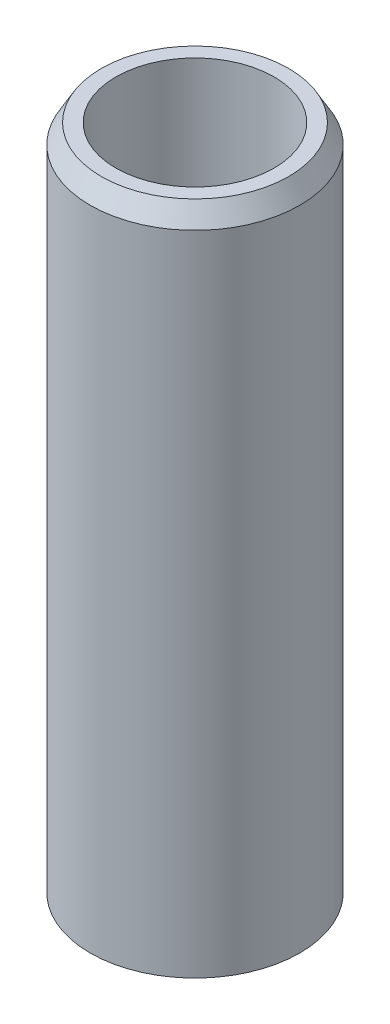
ISO-10303-21;
HEADER;
FILE_DESCRIPTION(('STEP AP214'),'2;1');
FILE_NAME('part.step','',(''),(''),'','','');
FILE_SCHEMA(('AUTOMOTIVE_DESIGN { 1 0 10303 214 1 1 1 1 }'));
ENDSEC;
DATA;
#1=APPLICATION_CONTEXT('core data for automotive mechanical design processes');
#2=APPLICATION_PROTOCOL_DEFINITION('international standard','automotive_design',2000,#1);
#3=PRODUCT_CONTEXT('',#1,'mechanical');
#4=PRODUCT('Part','Part','',(#3));
#5=PRODUCT_RELATED_PRODUCT_CATEGORY('part','',(#4));
#6=PRODUCT_DEFINITION_FORMATION('','',#4);
#7=PRODUCT_DEFINITION_CONTEXT('part definition',#1,'design');
#8=PRODUCT_DEFINITION('design','',#6,#7);
#9=PRODUCT_DEFINITION_SHAPE('','',#8);
#10=(LENGTH_UNIT() NAMED_UNIT(*) SI_UNIT(.MILLI.,.METRE.));
#11=(NAMED_UNIT(*) PLANE_ANGLE_UNIT() SI_UNIT($,.RADIAN.));
#12=(NAMED_UNIT(*) SI_UNIT($,.STERADIAN.) SOLID_ANGLE_UNIT());
#13=UNCERTAINTY_MEASURE_WITH_UNIT(LENGTH_MEASURE(1.E-05),#10,'distance_accuracy_value','');
#14=(GEOMETRIC_REPRESENTATION_CONTEXT(3) GLOBAL_UNCERTAINTY_ASSIGNED_CONTEXT((#13)) GLOBAL_UNIT_ASSIGNED_CONTEXT((#10,
#11,#12)) REPRESENTATION_CONTEXT('',''));
#15=CARTESIAN_POINT('',(0.,0.,0.));
#16=DIRECTION('',(0.,0.,1.));
#17=DIRECTION('',(1.,0.,0.));
#18=AXIS2_PLACEMENT_3D('',#15,#16,#17);
#19=CARTESIAN_POINT('',(0.,210.218991264737,0.));
#20=DIRECTION('',(0.,-1.,0.));
#21=DIRECTION('',(0.,0.,-1.));
#22=AXIS2_PLACEMENT_3D('',#19,#20,#21);
#23=CYLINDRICAL_SURFACE('',#22,32.5);
#24=CARTESIAN_POINT('',(0.,204.233746215276,0.));
#25=DIRECTION('',(0.,1.,0.));
#26=DIRECTION('',(0.,0.,1.));
#27=AXIS2_PLACEMENT_3D('',#24,#25,#26);
#28=CIRCLE('',#27,32.5);
#29=CARTESIAN_POINT('',(0.,204.233746215276,-32.5));
#30=VERTEX_POINT('',#29);
#31=EDGE_CURVE('E50',#30,#30,#28,.F.);
#32=CARTESIAN_POINT('',(0.,3.45558284047212,0.));
#33=DIRECTION('',(0.,1.,0.));
#34=DIRECTION('',(0.,0.,1.));
#35=AXIS2_PLACEMENT_3D('',#32,#33,#34);
#36=CIRCLE('',#35,32.5);
#37=CARTESIAN_POINT('',(0.,3.45558284047209,-32.5));
#38=VERTEX_POINT('',#37);
#39=EDGE_CURVE('E51',#38,#38,#36,.T.);
#40=CARTESIAN_POINT('',(0.,204.233746215276,-32.5));
#41=CARTESIAN_POINT('',(0.,202.142307013455,-32.5));
#42=CARTESIAN_POINT('',(0.,200.050867811635,-32.5));
#43=CARTESIAN_POINT('',(0.,195.867989407993,-32.5));
#44=CARTESIAN_POINT('',(0.,193.776550206172,-32.5));
#45=CARTESIAN_POINT('',(0.,189.59367180253,-32.5));
#46=CARTESIAN_POINT('',(0.,187.502232600709,-32.5));
#47=CARTESIAN_POINT('',(0.,183.319354197068,-32.5));
#48=CARTESIAN_POINT('',(0.,181.227914995247,-32.5));
#49=CARTESIAN_POINT('',(0.,177.045036591605,-32.5));
#50=CARTESIAN_POINT('',(0.,174.953597389784,-32.5));
#51=CARTESIAN_POINT('',(0.,170.770718986142,-32.5));
#52=CARTESIAN_POINT('',(0.,168.679279784321,-32.5));
#53=CARTESIAN_POINT('',(0.,164.49640138068,-32.5));
#54=CARTESIAN_POINT('',(0.,162.404962178859,-32.5));
#55=CARTESIAN_POINT('',(0.,158.222083775217,-32.5));
#56=CARTESIAN_POINT('',(0.,156.130644573396,-32.5));
#57=CARTESIAN_POINT('',(0.,151.947766169754,-32.5));
#58=CARTESIAN_POINT('',(0.,149.856326967934,-32.5));
#59=CARTESIAN_POINT('',(0.,145.673448564292,-32.5));
#60=CARTESIAN_POINT('',(0.,143.582009362471,-32.5));
#61=CARTESIAN_POINT('',(0.,139.399130958829,-32.5));
#62=CARTESIAN_POINT('',(0.,137.307691757008,-32.5));
#63=CARTESIAN_POINT('',(0.,133.124813353367,-32.5));
#64=CARTESIAN_POINT('',(0.,131.033374151546,-32.5));
#65=CARTESIAN_POINT('',(0.,126.850495747904,-32.5));
#66=CARTESIAN_POINT('',(0.,124.759056546083,-32.5));
#67=CARTESIAN_POINT('',(0.,120.576178142441,-32.5));
#68=CARTESIAN_POINT('',(0.,118.48473894062,-32.5));
#69=CARTESIAN_POINT('',(0.,114.301860536979,-32.5));
#70=CARTESIAN_POINT('',(0.,112.210421335158,-32.5));
#71=CARTESIAN_POINT('',(0.,108.027542931516,-32.5));
#72=CARTESIAN_POINT('',(0.,105.936103729695,-32.5));
#73=CARTESIAN_POINT('',(0.,101.753225326053,-32.5));
#74=CARTESIAN_POINT('',(0.,99.6617861242325,-32.5));
#75=CARTESIAN_POINT('',(0.,95.4789077205907,-32.5));
#76=CARTESIAN_POINT('',(0.,93.3874685187698,-32.5));
#77=CARTESIAN_POINT('',(0.,89.2045901151281,-32.5));
#78=CARTESIAN_POINT('',(0.,87.1131509133072,-32.5));
#79=CARTESIAN_POINT('',(0.,82.9302725096654,-32.5));
#80=CARTESIAN_POINT('',(0.,80.8388333078446,-32.5));
#81=CARTESIAN_POINT('',(0.,76.6559549042028,-32.5));
#82=CARTESIAN_POINT('',(0.,74.5645157023819,-32.5));
#83=CARTESIAN_POINT('',(0.,70.3816372987402,-32.5));
#84=CARTESIAN_POINT('',(0.,68.2901980969193,-32.5));
#85=CARTESIAN_POINT('',(0.,64.1073196932775,-32.5));
#86=CARTESIAN_POINT('',(0.,62.0158804914567,-32.5));
#87=CARTESIAN_POINT('',(0.,57.8330020878149,-32.5));
#88=CARTESIAN_POINT('',(0.,55.741562885994,-32.5));
#89=CARTESIAN_POINT('',(0.,51.5586844823523,-32.5));
#90=CARTESIAN_POINT('',(0.,49.4672452805314,-32.5));
#91=CARTESIAN_POINT('',(0.,45.2843668768896,-32.5));
#92=CARTESIAN_POINT('',(0.,43.1929276750688,-32.5));
#93=CARTESIAN_POINT('',(0.,39.010049271427,-32.5));
#94=CARTESIAN_POINT('',(0.,36.9186100696061,-32.5));
#95=CARTESIAN_POINT('',(0.,32.7357316659644,-32.5));
#96=CARTESIAN_POINT('',(0.,30.6442924641435,-32.5));
#97=CARTESIAN_POINT('',(0.,26.4614140605017,-32.5));
#98=CARTESIAN_POINT('',(0.,24.3699748586809,-32.5));
#99=CARTESIAN_POINT('',(0.,20.1870964550391,-32.5));
#100=CARTESIAN_POINT('',(0.,18.0956572532182,-32.5));
#101=CARTESIAN_POINT('',(0.,13.9127788495765,-32.5));
#102=CARTESIAN_POINT('',(0.,11.8213396477556,-32.5));
#103=CARTESIAN_POINT('',(0.,7.63846124411383,-32.5));
#104=CARTESIAN_POINT('',(0.,5.54702204229296,-32.5));
#105=CARTESIAN_POINT('',(0.,3.45558284047209,-32.5));
#106=B_SPLINE_CURVE_WITH_KNOTS('',3,(#40,#41,#42,#43,#44,#45,#46,#47,#48,#49,#50,#51,#52,#53,
#54,#55,#56,#57,#58,#59,#60,#61,#62,#63,#64,#65,#66,#67,#68,#69,#70,#71,#72,#73,#74,#75,#76,#77,
#78,#79,#80,#81,#82,#83,#84,#85,#86,#87,#88,#89,#90,#91,#92,#93,#94,#95,#96,#97,#98,#99,#100,
#101,#102,#103,#104,#105),.UNSPECIFIED.,.F.,.F.,(4,2,2,2,2,2,2,2,2,2,2,2,2,2,2,2,2,2,2,2,2,2,2,
2,2,2,2,2,2,2,2,2,4),(0.,6.27431760546265,12.5486352109253,18.8229528163879,25.0972704218506,
31.3715880273132,37.6459056327758,43.9202232382384,50.1945408437011,56.4688584491637,
62.7431760546263,69.017493660089,75.2918112655516,81.5661288710142,87.8404464764769,
94.1147640819395,100.389081687402,106.663399292865,112.937716898327,119.21203450379,
125.486352109253,131.760669714715,138.034987320178,144.309304925641,150.583622531103,
156.857940136566,163.132257742028,169.406575347491,175.680892952954,181.955210558416,
188.229528163879,194.503845769342,200.778163374804),.UNSPECIFIED.);
#107=EDGE_CURVE('BSEAM39',#30,#38,#106,.T.);
#108=ORIENTED_EDGE('',*,*,#31,.T.);
#109=ORIENTED_EDGE('',*,*,#39,.T.);
#110=ORIENTED_EDGE('',*,*,#107,.T.);
#111=ORIENTED_EDGE('',*,*,#107,.F.);
#112=EDGE_LOOP('',(#108,#110,#109,#111));
#113=FACE_BOUND('',#112,.T.);
#114=ADVANCED_FACE('F39',(#113),#23,.T.);
#115=CARTESIAN_POINT('',(0.,210.218991264737,0.));
#116=DIRECTION('',(0.,1.,0.));
#117=DIRECTION('',(0.,0.,1.));
#118=AXIS2_PLACEMENT_3D('',#115,#116,#117);
#119=PLANE('',#118);
#120=CARTESIAN_POINT('',(0.,210.218991264737,0.));
#121=DIRECTION('',(0.,1.,0.));
#122=DIRECTION('',(0.,0.,1.));
#123=AXIS2_PLACEMENT_3D('',#120,#121,#122);
#124=CIRCLE('',#123,29.0444171595281);
#125=CARTESIAN_POINT('',(0.,210.218991264737,29.0444171595281));
#126=VERTEX_POINT('',#125);
#127=EDGE_CURVE('E54',#126,#126,#124,.T.);
#128=ORIENTED_EDGE('',*,*,#127,.T.);
#129=EDGE_LOOP('',(#128));
#130=FACE_BOUND('',#129,.T.);
#131=CARTESIAN_POINT('',(0.,210.218991264737,0.));
#132=DIRECTION('',(0.,1.,0.));
#133=DIRECTION('',(0.,0.,1.));
#134=AXIS2_PLACEMENT_3D('',#131,#132,#133);
#135=CIRCLE('',#134,24.5213171670989);
#136=CARTESIAN_POINT('',(0.,210.218991264737,-24.5213171670989));
#137=VERTEX_POINT('',#136);
#138=EDGE_CURVE('E58',#137,#137,#135,.T.);
#139=ORIENTED_EDGE('',*,*,#138,.F.);
#140=EDGE_LOOP('',(#139));
#141=FACE_BOUND('',#140,.T.);
#142=ADVANCED_FACE('F69',(#130,#141),#119,.T.);
#143=CARTESIAN_POINT('',(0.,0.,0.));
#144=DIRECTION('',(0.,1.,0.));
#145=DIRECTION('',(0.,0.,1.));
#146=AXIS2_PLACEMENT_3D('',#143,#144,#145);
#147=PLANE('',#146);
#148=CARTESIAN_POINT('',(0.,0.,0.));
#149=DIRECTION('',(0.,1.,0.));
#150=DIRECTION('',(0.,0.,1.));
#151=AXIS2_PLACEMENT_3D('',#148,#149,#150);
#152=CIRCLE('',#151,26.5147549505391);
#153=CARTESIAN_POINT('',(0.,0.,26.5147549505391));
#154=VERTEX_POINT('',#153);
#155=EDGE_CURVE('E10',#154,#154,#152,.F.);
#156=ORIENTED_EDGE('',*,*,#155,.T.);
#157=EDGE_LOOP('',(#156));
#158=FACE_BOUND('',#157,.T.);
#159=CARTESIAN_POINT('',(0.,0.,0.));
#160=DIRECTION('',(0.,1.,0.));
#161=DIRECTION('',(0.,0.,1.));
#162=AXIS2_PLACEMENT_3D('',#159,#160,#161);
#163=CIRCLE('',#162,24.5213171670989);
#164=CARTESIAN_POINT('',(0.,0.,-24.5213171670989));
#165=VERTEX_POINT('',#164);
#166=EDGE_CURVE('E63',#165,#165,#163,.T.);
#167=ORIENTED_EDGE('',*,*,#166,.T.);
#168=EDGE_LOOP('',(#167));
#169=FACE_BOUND('',#168,.T.);
#170=ADVANCED_FACE('F75',(#158,#169),#147,.F.);
#171=CARTESIAN_POINT('',(0.,210.218991264737,0.));
#172=DIRECTION('',(0.,-1.,0.));
#173=DIRECTION('',(0.,0.,-1.));
#174=AXIS2_PLACEMENT_3D('',#171,#172,#173);
#175=CYLINDRICAL_SURFACE('',#174,24.5213171670989);
#176=CARTESIAN_POINT('',(0.,210.218991264737,-24.5213171670989));
#177=CARTESIAN_POINT('',(0.,208.029210105729,-24.5213171670989));
#178=CARTESIAN_POINT('',(0.,205.839428946722,-24.5213171670989));
#179=CARTESIAN_POINT('',(0.,201.459866628706,-24.5213171670989));
#180=CARTESIAN_POINT('',(0.,199.270085469699,-24.5213171670989));
#181=CARTESIAN_POINT('',(0.,194.890523151683,-24.5213171670989));
#182=CARTESIAN_POINT('',(0.,192.700741992676,-24.5213171670989));
#183=CARTESIAN_POINT('',(0.,188.32117967466,-24.5213171670989));
#184=CARTESIAN_POINT('',(0.,186.131398515653,-24.5213171670989));
#185=CARTESIAN_POINT('',(0.,181.751836197637,-24.5213171670989));
#186=CARTESIAN_POINT('',(0.,179.56205503863,-24.5213171670989));
#187=CARTESIAN_POINT('',(0.,175.182492720614,-24.5213171670989));
#188=CARTESIAN_POINT('',(0.,172.992711561606,-24.5213171670989));
#189=CARTESIAN_POINT('',(0.,168.613149243591,-24.5213171670989));
#190=CARTESIAN_POINT('',(0.,166.423368084583,-24.5213171670989));
#191=CARTESIAN_POINT('',(0.,162.043805766568,-24.5213171670989));
#192=CARTESIAN_POINT('',(0.,159.85402460756,-24.5213171670989));
#193=CARTESIAN_POINT('',(0.,155.474462289545,-24.5213171670989));
#194=CARTESIAN_POINT('',(0.,153.284681130537,-24.5213171670989));
#195=CARTESIAN_POINT('',(0.,148.905118812522,-24.5213171670989));
#196=CARTESIAN_POINT('',(0.,146.715337653514,-24.5213171670989));
#197=CARTESIAN_POINT('',(0.,142.335775335499,-24.5213171670989));
#198=CARTESIAN_POINT('',(0.,140.145994176491,-24.5213171670989));
#199=CARTESIAN_POINT('',(0.,135.766431858476,-24.5213171670989));
#200=CARTESIAN_POINT('',(0.,133.576650699468,-24.5213171670989));
#201=CARTESIAN_POINT('',(0.,129.197088381453,-24.5213171670989));
#202=CARTESIAN_POINT('',(0.,127.007307222445,-24.5213171670989));
#203=CARTESIAN_POINT('',(0.,122.62774490443,-24.5213171670989));
#204=CARTESIAN_POINT('',(0.,120.437963745422,-24.5213171670989));
#205=CARTESIAN_POINT('',(0.,116.058401427407,-24.5213171670989));
#206=CARTESIAN_POINT('',(0.,113.868620268399,-24.5213171670989));
#207=CARTESIAN_POINT('',(0.,109.489057950384,-24.5213171670989));
#208=CARTESIAN_POINT('',(0.,107.299276791376,-24.5213171670989));
#209=CARTESIAN_POINT('',(0.,102.919714473361,-24.5213171670989));
#210=CARTESIAN_POINT('',(0.,100.729933314353,-24.5213171670989));
#211=CARTESIAN_POINT('',(0.,96.3503709963378,-24.5213171670989));
#212=CARTESIAN_POINT('',(0.,94.1605898373301,-24.5213171670989));
#213=CARTESIAN_POINT('',(0.,89.7810275193147,-24.5213171670989));
#214=CARTESIAN_POINT('',(0.,87.5912463603071,-24.5213171670989));
#215=CARTESIAN_POINT('',(0.,83.2116840422917,-24.5213171670989));
#216=CARTESIAN_POINT('',(0.,81.0219028832841,-24.5213171670989));
#217=CARTESIAN_POINT('',(0.,76.6423405652687,-24.5213171670989));
#218=CARTESIAN_POINT('',(0.,74.452559406261,-24.5213171670989));
#219=CARTESIAN_POINT('',(0.,70.0729970882457,-24.5213171670989));
#220=CARTESIAN_POINT('',(0.,67.883215929238,-24.5213171670989));
#221=CARTESIAN_POINT('',(0.,63.5036536112226,-24.5213171670989));
#222=CARTESIAN_POINT('',(0.,61.313872452215,-24.5213171670989));
#223=CARTESIAN_POINT('',(0.,56.9343101341996,-24.5213171670989));
#224=CARTESIAN_POINT('',(0.,54.7445289751919,-24.5213171670989));
#225=CARTESIAN_POINT('',(0.,50.3649666571766,-24.5213171670989));
#226=CARTESIAN_POINT('',(0.,48.1751854981689,-24.5213171670989));
#227=CARTESIAN_POINT('',(0.,43.7956231801536,-24.5213171670989));
#228=CARTESIAN_POINT('',(0.,41.6058420211459,-24.5213171670989));
#229=CARTESIAN_POINT('',(0.,37.2262797031305,-24.5213171670989));
#230=CARTESIAN_POINT('',(0.,35.0364985441228,-24.5213171670989));
#231=CARTESIAN_POINT('',(0.,30.6569362261075,-24.5213171670989));
#232=CARTESIAN_POINT('',(0.,28.4671550670998,-24.5213171670989));
#233=CARTESIAN_POINT('',(0.,24.0875927490844,-24.5213171670989));
#234=CARTESIAN_POINT('',(0.,21.8978115900768,-24.5213171670989));
#235=CARTESIAN_POINT('',(0.,17.5182492720614,-24.5213171670989));
#236=CARTESIAN_POINT('',(0.,15.3284681130537,-24.5213171670989));
#237=CARTESIAN_POINT('',(0.,10.9489057950384,-24.5213171670989));
#238=CARTESIAN_POINT('',(0.,8.75912463603072,-24.5213171670989));
#239=CARTESIAN_POINT('',(0.,4.37956231801536,-24.5213171670989));
#240=CARTESIAN_POINT('',(0.,2.18978115900768,-24.5213171670989));
#241=CARTESIAN_POINT('',(0.,0.,-24.5213171670989));
#242=B_SPLINE_CURVE_WITH_KNOTS('',3,(#176,#177,#178,#179,#180,#181,#182,#183,#184,#185,#186,
#187,#188,#189,#190,#191,#192,#193,#194,#195,#196,#197,#198,#199,#200,#201,#202,#203,#204,#205,
#206,#207,#208,#209,#210,#211,#212,#213,#214,#215,#216,#217,#218,#219,#220,#221,#222,#223,#224,
#225,#226,#227,#228,#229,#230,#231,#232,#233,#234,#235,#236,#237,#238,#239,#240,#241),
.UNSPECIFIED.,.F.,.F.,(4,2,2,2,2,2,2,2,2,2,2,2,2,2,2,2,2,2,2,2,2,2,2,2,2,2,2,2,2,2,2,2,4),(0.,
6.56934347702304,13.1386869540461,19.7080304310691,26.2773739080922,32.8467173851152,
39.4160608621382,45.9854043391612,52.5547478161843,59.1240912932073,65.6934347702303,
72.2627782472534,78.8321217242764,85.4014652012994,91.9708086783225,98.5401521553455,
105.109495632369,111.678839109392,118.248182586415,124.817526063438,131.386869540461,
137.956213017484,144.525556494507,151.09489997153,157.664243448553,164.233586925576,
170.802930402599,177.372273879622,183.941617356645,190.510960833668,197.080304310691,
203.649647787714,210.218991264737),.UNSPECIFIED.);
#243=EDGE_CURVE('BSEAM70',#137,#165,#242,.T.);
#244=ORIENTED_EDGE('',*,*,#138,.T.);
#245=ORIENTED_EDGE('',*,*,#166,.F.);
#246=ORIENTED_EDGE('',*,*,#243,.T.);
#247=ORIENTED_EDGE('',*,*,#243,.F.);
#248=EDGE_LOOP('',(#244,#246,#245,#247));
#249=FACE_BOUND('',#248,.T.);
#250=ADVANCED_FACE('F70',(#249),#175,.F.);
#251=CARTESIAN_POINT('',(0.,210.218991264737,0.));
#252=DIRECTION('',(0.,-1.,0.));
#253=DIRECTION('',(0.,0.,-1.));
#254=AXIS2_PLACEMENT_3D('',#251,#252,#253);
#255=CONICAL_SURFACE('',#254,29.0444171595281,0.52359877559829);
#256=ORIENTED_EDGE('',*,*,#31,.F.);
#257=EDGE_LOOP('',(#256));
#258=FACE_BOUND('',#257,.T.);
#259=ORIENTED_EDGE('',*,*,#127,.F.);
#260=EDGE_LOOP('',(#259));
#261=FACE_BOUND('',#260,.T.);
#262=ADVANCED_FACE('F81',(#258,#261),#255,.T.);
#263=CARTESIAN_POINT('',(0.,3.45558284047212,0.));
#264=DIRECTION('',(0.,1.,0.));
#265=DIRECTION('',(0.,0.,1.));
#266=AXIS2_PLACEMENT_3D('',#263,#264,#265);
#267=CONICAL_SURFACE('',#266,32.5,1.0471975511966);
#268=ORIENTED_EDGE('',*,*,#155,.F.);
#269=EDGE_LOOP('',(#268));
#270=FACE_BOUND('',#269,.T.);
#271=ORIENTED_EDGE('',*,*,#39,.F.);
#272=EDGE_LOOP('',(#271));
#273=FACE_BOUND('',#272,.T.);
#274=ADVANCED_FACE('F45',(#270,#273),#267,.T.);
#275=CLOSED_SHELL('',(#114,#142,#170,#250,#262,#274));
#276=MANIFOLD_SOLID_BREP('B2',#275);
#277=ADVANCED_BREP_SHAPE_REPRESENTATION('',(#18,#276),#14);
#278=SHAPE_DEFINITION_REPRESENTATION(#9,#277);
ENDSEC;
END-ISO-10303-21;
